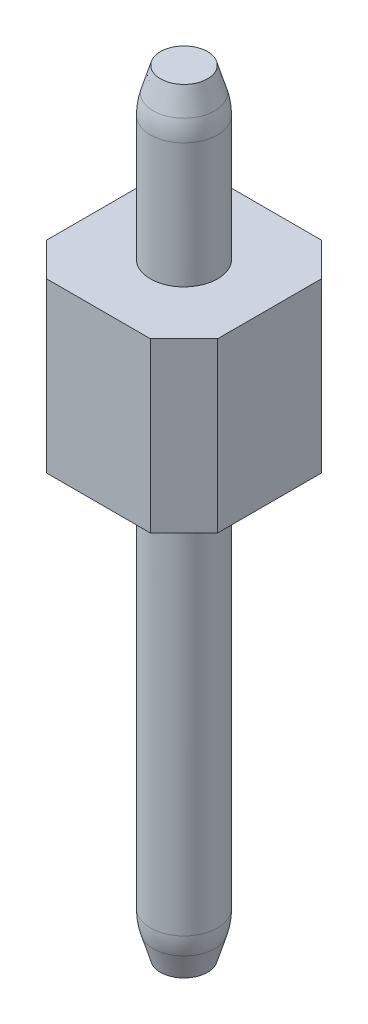
ISO-10303-21;
HEADER;
FILE_DESCRIPTION(('STEP AP214'),'2;1');
FILE_NAME('part.step','',(''),(''),'','','');
FILE_SCHEMA(('AUTOMOTIVE_DESIGN { 1 0 10303 214 1 1 1 1 }'));
ENDSEC;
DATA;
#1=APPLICATION_CONTEXT('core data for automotive mechanical design processes');
#2=APPLICATION_PROTOCOL_DEFINITION('international standard','automotive_design',2000,#1);
#3=PRODUCT_CONTEXT('',#1,'mechanical');
#4=PRODUCT('Part','Part','',(#3));
#5=PRODUCT_RELATED_PRODUCT_CATEGORY('part','',(#4));
#6=PRODUCT_DEFINITION_FORMATION('','',#4);
#7=PRODUCT_DEFINITION_CONTEXT('part definition',#1,'design');
#8=PRODUCT_DEFINITION('design','',#6,#7);
#9=PRODUCT_DEFINITION_SHAPE('','',#8);
#10=(LENGTH_UNIT() NAMED_UNIT(*) SI_UNIT(.MILLI.,.METRE.));
#11=(NAMED_UNIT(*) PLANE_ANGLE_UNIT() SI_UNIT($,.RADIAN.));
#12=(NAMED_UNIT(*) SI_UNIT($,.STERADIAN.) SOLID_ANGLE_UNIT());
#13=UNCERTAINTY_MEASURE_WITH_UNIT(LENGTH_MEASURE(1.E-05),#10,'distance_accuracy_value','');
#14=(GEOMETRIC_REPRESENTATION_CONTEXT(3) GLOBAL_UNCERTAINTY_ASSIGNED_CONTEXT((#13)) GLOBAL_UNIT_ASSIGNED_CONTEXT((#10,
#11,#12)) REPRESENTATION_CONTEXT('',''));
#15=CARTESIAN_POINT('',(0.,0.,0.));
#16=DIRECTION('',(0.,0.,1.));
#17=DIRECTION('',(1.,0.,0.));
#18=AXIS2_PLACEMENT_3D('',#15,#16,#17);
#19=CARTESIAN_POINT('',(0.,11.5,0.));
#20=DIRECTION('',(0.,-1.,0.));
#21=DIRECTION('',(0.,0.,-1.));
#22=AXIS2_PLACEMENT_3D('',#19,#20,#21);
#23=CYLINDRICAL_SURFACE('',#22,0.5);
#24=CARTESIAN_POINT('',(0.,10.8532311636965,0.));
#25=DIRECTION('',(0.,1.,0.));
#26=DIRECTION('',(0.,0.,1.));
#27=AXIS2_PLACEMENT_3D('',#24,#25,#26);
#28=CIRCLE('',#27,0.5);
#29=CARTESIAN_POINT('',(0.,10.8532311636965,0.5));
#30=VERTEX_POINT('',#29);
#31=EDGE_CURVE('E179',#30,#30,#28,.F.);
#32=ORIENTED_EDGE('',*,*,#31,.T.);
#33=EDGE_LOOP('',(#32));
#34=FACE_BOUND('',#33,.T.);
#35=CARTESIAN_POINT('',(0.,9.,0.));
#36=DIRECTION('',(0.,-1.,0.));
#37=DIRECTION('',(0.,0.,-1.));
#38=AXIS2_PLACEMENT_3D('',#35,#36,#37);
#39=CIRCLE('',#38,0.5);
#40=CARTESIAN_POINT('',(0.,9.,-0.5));
#41=VERTEX_POINT('',#40);
#42=EDGE_CURVE('E173',#41,#41,#39,.T.);
#43=ORIENTED_EDGE('',*,*,#42,.F.);
#44=EDGE_LOOP('',(#43));
#45=FACE_BOUND('',#44,.T.);
#46=ADVANCED_FACE('F48',(#34,#45),#23,.T.);
#47=CARTESIAN_POINT('',(0.,11.5,0.));
#48=DIRECTION('',(0.,1.,0.));
#49=DIRECTION('',(0.,0.,1.));
#50=AXIS2_PLACEMENT_3D('',#47,#48,#49);
#51=PLANE('',#50);
#52=CARTESIAN_POINT('',(0.,11.5,0.));
#53=DIRECTION('',(0.,1.,0.));
#54=DIRECTION('',(0.,0.,1.));
#55=AXIS2_PLACEMENT_3D('',#52,#53,#54);
#56=CIRCLE('',#55,0.350000000000005);
#57=CARTESIAN_POINT('',(0.,11.5,0.350000000000005));
#58=VERTEX_POINT('',#57);
#59=EDGE_CURVE('E176',#58,#58,#56,.T.);
#60=ORIENTED_EDGE('',*,*,#59,.T.);
#61=EDGE_LOOP('',(#60));
#62=FACE_BOUND('',#61,.T.);
#63=ADVANCED_FACE('F225',(#62),#51,.T.);
#64=CARTESIAN_POINT('',(-1.27,9.,0.77));
#65=DIRECTION('',(1.,0.,0.));
#66=DIRECTION('',(0.,0.,-1.));
#67=AXIS2_PLACEMENT_3D('',#64,#65,#66);
#68=PLANE('',#67);
#69=DIRECTION('',(0.,0.,1.));
#70=VECTOR('',#69,1.);
#71=CARTESIAN_POINT('',(-1.27,6.5,0.77));
#72=LINE('',#71,#70);
#73=CARTESIAN_POINT('',(-1.27,6.5,-0.77));
#74=VERTEX_POINT('',#73);
#75=CARTESIAN_POINT('',(-1.27,6.5,0.77));
#76=VERTEX_POINT('',#75);
#77=EDGE_CURVE('E143',#74,#76,#72,.T.);
#78=ORIENTED_EDGE('',*,*,#77,.T.);
#79=DIRECTION('',(0.,-1.,0.));
#80=VECTOR('',#79,1.);
#81=CARTESIAN_POINT('',(-1.27,9.,0.77));
#82=LINE('',#81,#80);
#83=CARTESIAN_POINT('',(-1.27,9.,0.77));
#84=VERTEX_POINT('',#83);
#85=EDGE_CURVE('E168',#84,#76,#82,.T.);
#86=ORIENTED_EDGE('',*,*,#85,.F.);
#87=DIRECTION('',(0.,0.,1.));
#88=VECTOR('',#87,1.);
#89=CARTESIAN_POINT('',(-1.27,9.,0.77));
#90=LINE('',#89,#88);
#91=CARTESIAN_POINT('',(-1.27,9.,-0.77));
#92=VERTEX_POINT('',#91);
#93=EDGE_CURVE('E156',#92,#84,#90,.T.);
#94=ORIENTED_EDGE('',*,*,#93,.F.);
#95=DIRECTION('',(0.,-1.,0.));
#96=VECTOR('',#95,1.);
#97=CARTESIAN_POINT('',(-1.27,9.,-0.77));
#98=LINE('',#97,#96);
#99=EDGE_CURVE('E139',#92,#74,#98,.T.);
#100=ORIENTED_EDGE('',*,*,#99,.T.);
#101=EDGE_LOOP('',(#78,#86,#94,#100));
#102=FACE_BOUND('',#101,.T.);
#103=ADVANCED_FACE('F230',(#102),#68,.F.);
#104=CARTESIAN_POINT('',(-1.27,9.,0.77));
#105=DIRECTION('',(0.707106781186548,0.,-0.707106781186548));
#106=DIRECTION('',(-0.707106781186548,0.,-0.707106781186548));
#107=AXIS2_PLACEMENT_3D('',#104,#105,#106);
#108=PLANE('',#107);
#109=DIRECTION('',(0.707106781186548,0.,0.707106781186548));
#110=VECTOR('',#109,1.);
#111=CARTESIAN_POINT('',(-1.27,6.5,0.77));
#112=LINE('',#111,#110);
#113=CARTESIAN_POINT('',(-0.77,6.5,1.27));
#114=VERTEX_POINT('',#113);
#115=EDGE_CURVE('E146',#76,#114,#112,.T.);
#116=ORIENTED_EDGE('',*,*,#115,.T.);
#117=DIRECTION('',(0.,-1.,0.));
#118=VECTOR('',#117,1.);
#119=CARTESIAN_POINT('',(-0.77,9.,1.27));
#120=LINE('',#119,#118);
#121=CARTESIAN_POINT('',(-0.77,9.,1.27));
#122=VERTEX_POINT('',#121);
#123=EDGE_CURVE('E165',#122,#114,#120,.T.);
#124=ORIENTED_EDGE('',*,*,#123,.F.);
#125=DIRECTION('',(0.707106781186548,0.,0.707106781186548));
#126=VECTOR('',#125,1.);
#127=CARTESIAN_POINT('',(-1.27,9.,0.77));
#128=LINE('',#127,#126);
#129=EDGE_CURVE('E107',#84,#122,#128,.T.);
#130=ORIENTED_EDGE('',*,*,#129,.F.);
#131=ORIENTED_EDGE('',*,*,#85,.T.);
#132=EDGE_LOOP('',(#116,#124,#130,#131));
#133=FACE_BOUND('',#132,.T.);
#134=ADVANCED_FACE('F303',(#133),#108,.F.);
#135=CARTESIAN_POINT('',(-0.77,9.,1.27));
#136=DIRECTION('',(0.,0.,-1.));
#137=DIRECTION('',(-1.,0.,0.));
#138=AXIS2_PLACEMENT_3D('',#135,#136,#137);
#139=PLANE('',#138);
#140=DIRECTION('',(1.,0.,0.));
#141=VECTOR('',#140,1.);
#142=CARTESIAN_POINT('',(-0.77,6.5,1.27));
#143=LINE('',#142,#141);
#144=CARTESIAN_POINT('',(0.77,6.5,1.27));
#145=VERTEX_POINT('',#144);
#146=EDGE_CURVE('E148',#114,#145,#143,.T.);
#147=ORIENTED_EDGE('',*,*,#146,.T.);
#148=DIRECTION('',(0.,-1.,0.));
#149=VECTOR('',#148,1.);
#150=CARTESIAN_POINT('',(0.77,9.,1.27));
#151=LINE('',#150,#149);
#152=CARTESIAN_POINT('',(0.77,9.,1.27));
#153=VERTEX_POINT('',#152);
#154=EDGE_CURVE('E162',#153,#145,#151,.T.);
#155=ORIENTED_EDGE('',*,*,#154,.F.);
#156=DIRECTION('',(1.,0.,0.));
#157=VECTOR('',#156,1.);
#158=CARTESIAN_POINT('',(-0.77,9.,1.27));
#159=LINE('',#158,#157);
#160=EDGE_CURVE('E377',#122,#153,#159,.T.);
#161=ORIENTED_EDGE('',*,*,#160,.F.);
#162=ORIENTED_EDGE('',*,*,#123,.T.);
#163=EDGE_LOOP('',(#147,#155,#161,#162));
#164=FACE_BOUND('',#163,.T.);
#165=ADVANCED_FACE('F292',(#164),#139,.F.);
#166=CARTESIAN_POINT('',(0.77,9.,1.27));
#167=DIRECTION('',(-0.707106781186548,0.,-0.707106781186548));
#168=DIRECTION('',(-0.707106781186548,0.,0.707106781186548));
#169=AXIS2_PLACEMENT_3D('',#166,#167,#168);
#170=PLANE('',#169);
#171=DIRECTION('',(0.707106781186548,0.,-0.707106781186548));
#172=VECTOR('',#171,1.);
#173=CARTESIAN_POINT('',(0.77,6.5,1.27));
#174=LINE('',#173,#172);
#175=CARTESIAN_POINT('',(1.27,6.5,0.77));
#176=VERTEX_POINT('',#175);
#177=EDGE_CURVE('E150',#145,#176,#174,.T.);
#178=ORIENTED_EDGE('',*,*,#177,.T.);
#179=DIRECTION('',(0.,-1.,0.));
#180=VECTOR('',#179,1.);
#181=CARTESIAN_POINT('',(1.27,9.,0.77));
#182=LINE('',#181,#180);
#183=CARTESIAN_POINT('',(1.27,9.,0.77));
#184=VERTEX_POINT('',#183);
#185=EDGE_CURVE('E160',#184,#176,#182,.T.);
#186=ORIENTED_EDGE('',*,*,#185,.F.);
#187=DIRECTION('',(0.707106781186548,0.,-0.707106781186548));
#188=VECTOR('',#187,1.);
#189=CARTESIAN_POINT('',(0.77,9.,1.27));
#190=LINE('',#189,#188);
#191=EDGE_CURVE('E128',#153,#184,#190,.T.);
#192=ORIENTED_EDGE('',*,*,#191,.F.);
#193=ORIENTED_EDGE('',*,*,#154,.T.);
#194=EDGE_LOOP('',(#178,#186,#192,#193));
#195=FACE_BOUND('',#194,.T.);
#196=ADVANCED_FACE('F282',(#195),#170,.F.);
#197=CARTESIAN_POINT('',(0.77,9.,-1.27));
#198=DIRECTION('',(-0.707106781186548,0.,0.707106781186548));
#199=DIRECTION('',(0.707106781186548,0.,0.707106781186548));
#200=AXIS2_PLACEMENT_3D('',#197,#198,#199);
#201=PLANE('',#200);
#202=DIRECTION('',(-0.707106781186548,0.,-0.707106781186548));
#203=VECTOR('',#202,1.);
#204=CARTESIAN_POINT('',(0.77,6.5,-1.27));
#205=LINE('',#204,#203);
#206=CARTESIAN_POINT('',(1.27,6.5,-0.77));
#207=VERTEX_POINT('',#206);
#208=CARTESIAN_POINT('',(0.77,6.5,-1.27));
#209=VERTEX_POINT('',#208);
#210=EDGE_CURVE('E133',#207,#209,#205,.T.);
#211=ORIENTED_EDGE('',*,*,#210,.T.);
#212=DIRECTION('',(0.,-1.,0.));
#213=VECTOR('',#212,1.);
#214=CARTESIAN_POINT('',(0.77,9.,-1.27));
#215=LINE('',#214,#213);
#216=CARTESIAN_POINT('',(0.77,9.,-1.27));
#217=VERTEX_POINT('',#216);
#218=EDGE_CURVE('E130',#217,#209,#215,.T.);
#219=ORIENTED_EDGE('',*,*,#218,.F.);
#220=DIRECTION('',(-0.707106781186548,0.,-0.707106781186548));
#221=VECTOR('',#220,1.);
#222=CARTESIAN_POINT('',(0.77,9.,-1.27));
#223=LINE('',#222,#221);
#224=CARTESIAN_POINT('',(1.27,9.,-0.77));
#225=VERTEX_POINT('',#224);
#226=EDGE_CURVE('E117',#225,#217,#223,.T.);
#227=ORIENTED_EDGE('',*,*,#226,.F.);
#228=DIRECTION('',(0.,-1.,0.));
#229=VECTOR('',#228,1.);
#230=CARTESIAN_POINT('',(1.27,9.,-0.77));
#231=LINE('',#230,#229);
#232=EDGE_CURVE('E134',#225,#207,#231,.T.);
#233=ORIENTED_EDGE('',*,*,#232,.T.);
#234=EDGE_LOOP('',(#211,#219,#227,#233));
#235=FACE_BOUND('',#234,.T.);
#236=ADVANCED_FACE('F131',(#235),#201,.F.);
#237=CARTESIAN_POINT('',(-0.77,9.,-1.27));
#238=DIRECTION('',(0.,0.,1.));
#239=DIRECTION('',(1.,0.,0.));
#240=AXIS2_PLACEMENT_3D('',#237,#238,#239);
#241=PLANE('',#240);
#242=DIRECTION('',(-1.,0.,0.));
#243=VECTOR('',#242,1.);
#244=CARTESIAN_POINT('',(-0.77,6.5,-1.27));
#245=LINE('',#244,#243);
#246=CARTESIAN_POINT('',(-0.77,6.5,-1.27));
#247=VERTEX_POINT('',#246);
#248=EDGE_CURVE('E92',#209,#247,#245,.T.);
#249=ORIENTED_EDGE('',*,*,#248,.T.);
#250=DIRECTION('',(0.,-1.,0.));
#251=VECTOR('',#250,1.);
#252=CARTESIAN_POINT('',(-0.77,9.,-1.27));
#253=LINE('',#252,#251);
#254=CARTESIAN_POINT('',(-0.77,9.,-1.27));
#255=VERTEX_POINT('',#254);
#256=EDGE_CURVE('E135',#255,#247,#253,.T.);
#257=ORIENTED_EDGE('',*,*,#256,.F.);
#258=DIRECTION('',(-1.,0.,0.));
#259=VECTOR('',#258,1.);
#260=CARTESIAN_POINT('',(-0.77,9.,-1.27));
#261=LINE('',#260,#259);
#262=EDGE_CURVE('E122',#217,#255,#261,.T.);
#263=ORIENTED_EDGE('',*,*,#262,.F.);
#264=ORIENTED_EDGE('',*,*,#218,.T.);
#265=EDGE_LOOP('',(#249,#257,#263,#264));
#266=FACE_BOUND('',#265,.T.);
#267=ADVANCED_FACE('F137',(#266),#241,.F.);
#268=CARTESIAN_POINT('',(-1.27,9.,-0.77));
#269=DIRECTION('',(0.707106781186548,0.,0.707106781186548));
#270=DIRECTION('',(0.707106781186548,0.,-0.707106781186548));
#271=AXIS2_PLACEMENT_3D('',#268,#269,#270);
#272=PLANE('',#271);
#273=DIRECTION('',(-0.707106781186548,0.,0.707106781186548));
#274=VECTOR('',#273,1.);
#275=CARTESIAN_POINT('',(-1.27,6.5,-0.77));
#276=LINE('',#275,#274);
#277=EDGE_CURVE('E98',#247,#74,#276,.T.);
#278=ORIENTED_EDGE('',*,*,#277,.T.);
#279=ORIENTED_EDGE('',*,*,#99,.F.);
#280=DIRECTION('',(-0.707106781186548,0.,0.707106781186548));
#281=VECTOR('',#280,1.);
#282=CARTESIAN_POINT('',(-1.27,9.,-0.77));
#283=LINE('',#282,#281);
#284=EDGE_CURVE('E65',#255,#92,#283,.T.);
#285=ORIENTED_EDGE('',*,*,#284,.F.);
#286=ORIENTED_EDGE('',*,*,#256,.T.);
#287=EDGE_LOOP('',(#278,#279,#285,#286));
#288=FACE_BOUND('',#287,.T.);
#289=ADVANCED_FACE('F219',(#288),#272,.F.);
#290=CARTESIAN_POINT('',(0.,9.,0.));
#291=DIRECTION('',(0.,-1.,0.));
#292=DIRECTION('',(0.,0.,-1.));
#293=AXIS2_PLACEMENT_3D('',#290,#291,#292);
#294=PLANE('',#293);
#295=ORIENTED_EDGE('',*,*,#42,.T.);
#296=EDGE_LOOP('',(#295));
#297=FACE_BOUND('',#296,.T.);
#298=ORIENTED_EDGE('',*,*,#191,.T.);
#299=DIRECTION('',(0.,0.,-1.));
#300=VECTOR('',#299,1.);
#301=CARTESIAN_POINT('',(1.27,9.,0.));
#302=LINE('',#301,#300);
#303=EDGE_CURVE('E125',#184,#225,#302,.T.);
#304=ORIENTED_EDGE('',*,*,#303,.T.);
#305=ORIENTED_EDGE('',*,*,#226,.T.);
#306=ORIENTED_EDGE('',*,*,#262,.T.);
#307=ORIENTED_EDGE('',*,*,#284,.T.);
#308=ORIENTED_EDGE('',*,*,#93,.T.);
#309=ORIENTED_EDGE('',*,*,#129,.T.);
#310=ORIENTED_EDGE('',*,*,#160,.T.);
#311=EDGE_LOOP('',(#298,#304,#305,#306,#307,#308,#309,#310));
#312=FACE_BOUND('',#311,.T.);
#313=ADVANCED_FACE('F120',(#297,#312),#294,.F.);
#314=CARTESIAN_POINT('',(0.,6.5,0.));
#315=DIRECTION('',(0.,-1.,0.));
#316=DIRECTION('',(0.,0.,-1.));
#317=AXIS2_PLACEMENT_3D('',#314,#315,#316);
#318=PLANE('',#317);
#319=DIRECTION('',(0.,0.,-1.));
#320=VECTOR('',#319,1.);
#321=CARTESIAN_POINT('',(1.27,6.5,0.));
#322=LINE('',#321,#320);
#323=EDGE_CURVE('E13',#176,#207,#322,.T.);
#324=ORIENTED_EDGE('',*,*,#323,.F.);
#325=ORIENTED_EDGE('',*,*,#177,.F.);
#326=ORIENTED_EDGE('',*,*,#146,.F.);
#327=ORIENTED_EDGE('',*,*,#115,.F.);
#328=ORIENTED_EDGE('',*,*,#77,.F.);
#329=ORIENTED_EDGE('',*,*,#277,.F.);
#330=ORIENTED_EDGE('',*,*,#248,.F.);
#331=ORIENTED_EDGE('',*,*,#210,.F.);
#332=EDGE_LOOP('',(#324,#325,#326,#327,#328,#329,#330,#331));
#333=FACE_BOUND('',#332,.T.);
#334=CARTESIAN_POINT('',(0.,6.5,0.));
#335=DIRECTION('',(0.,-1.,0.));
#336=DIRECTION('',(0.,0.,-1.));
#337=AXIS2_PLACEMENT_3D('',#334,#335,#336);
#338=CIRCLE('',#337,0.5);
#339=CARTESIAN_POINT('',(0.,6.5,-0.5));
#340=VERTEX_POINT('',#339);
#341=EDGE_CURVE('E170',#340,#340,#338,.T.);
#342=ORIENTED_EDGE('',*,*,#341,.F.);
#343=EDGE_LOOP('',(#342));
#344=FACE_BOUND('',#343,.T.);
#345=ADVANCED_FACE('F209',(#333,#344),#318,.T.);
#346=CARTESIAN_POINT('',(0.,0.,0.));
#347=DIRECTION('',(0.,1.,0.));
#348=DIRECTION('',(0.,0.,1.));
#349=AXIS2_PLACEMENT_3D('',#346,#347,#348);
#350=PLANE('',#349);
#351=CARTESIAN_POINT('',(0.,0.,0.));
#352=DIRECTION('',(0.,1.,0.));
#353=DIRECTION('',(0.,0.,1.));
#354=AXIS2_PLACEMENT_3D('',#351,#352,#353);
#355=CIRCLE('',#354,0.349999999999994);
#356=CARTESIAN_POINT('',(0.,0.,0.349999999999994));
#357=VERTEX_POINT('',#356);
#358=EDGE_CURVE('E185',#357,#357,#355,.F.);
#359=ORIENTED_EDGE('',*,*,#358,.T.);
#360=EDGE_LOOP('',(#359));
#361=FACE_BOUND('',#360,.T.);
#362=ADVANCED_FACE('F205',(#361),#350,.F.);
#363=CARTESIAN_POINT('',(0.,0.646768836303538,0.));
#364=DIRECTION('',(0.,-1.,0.));
#365=DIRECTION('',(0.,0.,-1.));
#366=AXIS2_PLACEMENT_3D('',#363,#364,#365);
#367=CIRCLE('',#366,0.5);
#368=CARTESIAN_POINT('',(0.,0.646768836303538,-0.5));
#369=VERTEX_POINT('',#368);
#370=EDGE_CURVE('E188',#369,#369,#367,.F.);
#371=ORIENTED_EDGE('',*,*,#370,.T.);
#372=EDGE_LOOP('',(#371));
#373=FACE_BOUND('',#372,.T.);
#374=ORIENTED_EDGE('',*,*,#341,.T.);
#375=EDGE_LOOP('',(#374));
#376=FACE_BOUND('',#375,.T.);
#377=ADVANCED_FACE('F201',(#373,#376),#23,.T.);
#378=CARTESIAN_POINT('',(0.,11.5,0.));
#379=DIRECTION('',(0.,-1.,0.));
#380=DIRECTION('',(0.,0.,-1.));
#381=AXIS2_PLACEMENT_3D('',#378,#379,#380);
#382=CONICAL_SURFACE('',#381,0.350000000000005,0.291456794477864);
#383=CARTESIAN_POINT('',(0.,11.1405790492628,0.));
#384=DIRECTION('',(0.,-1.,0.));
#385=DIRECTION('',(0.,0.,-1.));
#386=AXIS2_PLACEMENT_3D('',#383,#384,#385);
#387=CIRCLE('',#386,0.457826285221153);
#388=CARTESIAN_POINT('',(0.,11.1405790492628,-0.457826285221153));
#389=VERTEX_POINT('',#388);
#390=EDGE_CURVE('E182',#389,#389,#387,.F.);
#391=ORIENTED_EDGE('',*,*,#390,.T.);
#392=EDGE_LOOP('',(#391));
#393=FACE_BOUND('',#392,.T.);
#394=ORIENTED_EDGE('',*,*,#59,.F.);
#395=EDGE_LOOP('',(#394));
#396=FACE_BOUND('',#395,.T.);
#397=ADVANCED_FACE('F204',(#393,#396),#382,.T.);
#398=CARTESIAN_POINT('',(0.,10.8532311636965,0.));
#399=DIRECTION('',(0.,1.,0.));
#400=DIRECTION('',(0.,0.,1.));
#401=AXIS2_PLACEMENT_3D('',#398,#399,#400);
#402=DEGENERATE_TOROIDAL_SURFACE('',#401,0.5,1.,.F.);
#403=ORIENTED_EDGE('',*,*,#390,.F.);
#404=EDGE_LOOP('',(#403));
#405=FACE_BOUND('',#404,.T.);
#406=ORIENTED_EDGE('',*,*,#31,.F.);
#407=EDGE_LOOP('',(#406));
#408=FACE_BOUND('',#407,.T.);
#409=ADVANCED_FACE('F237',(#405,#408),#402,.F.);
#410=CARTESIAN_POINT('',(0.,0.500000000000021,0.));
#411=DIRECTION('',(0.,1.,0.));
#412=DIRECTION('',(0.,0.,1.));
#413=AXIS2_PLACEMENT_3D('',#410,#411,#412);
#414=CONICAL_SURFACE('',#413,0.5,0.291456794477866);
#415=CARTESIAN_POINT('',(0.,0.359420950737193,0.));
#416=DIRECTION('',(0.,1.,0.));
#417=DIRECTION('',(0.,0.,1.));
#418=AXIS2_PLACEMENT_3D('',#415,#416,#417);
#419=CIRCLE('',#418,0.457826285221152);
#420=CARTESIAN_POINT('',(0.,0.359420950737193,0.457826285221152));
#421=VERTEX_POINT('',#420);
#422=EDGE_CURVE('E57',#421,#421,#419,.F.);
#423=ORIENTED_EDGE('',*,*,#422,.T.);
#424=EDGE_LOOP('',(#423));
#425=FACE_BOUND('',#424,.T.);
#426=ORIENTED_EDGE('',*,*,#358,.F.);
#427=EDGE_LOOP('',(#426));
#428=FACE_BOUND('',#427,.T.);
#429=ADVANCED_FACE('F193',(#425,#428),#414,.T.);
#430=CARTESIAN_POINT('',(0.,0.646768836303538,0.));
#431=DIRECTION('',(0.,-1.,0.));
#432=DIRECTION('',(0.,0.,-1.));
#433=AXIS2_PLACEMENT_3D('',#430,#431,#432);
#434=DEGENERATE_TOROIDAL_SURFACE('',#433,0.5,1.,.F.);
#435=ORIENTED_EDGE('',*,*,#422,.F.);
#436=EDGE_LOOP('',(#435));
#437=FACE_BOUND('',#436,.T.);
#438=ORIENTED_EDGE('',*,*,#370,.F.);
#439=EDGE_LOOP('',(#438));
#440=FACE_BOUND('',#439,.T.);
#441=ADVANCED_FACE('F50',(#437,#440),#434,.F.);
#442=CARTESIAN_POINT('',(1.27,11.5,-1.27));
#443=DIRECTION('',(-1.,0.,0.));
#444=DIRECTION('',(0.,0.,1.));
#445=AXIS2_PLACEMENT_3D('',#442,#443,#444);
#446=PLANE('',#445);
#447=ORIENTED_EDGE('',*,*,#185,.T.);
#448=ORIENTED_EDGE('',*,*,#323,.T.);
#449=ORIENTED_EDGE('',*,*,#232,.F.);
#450=ORIENTED_EDGE('',*,*,#303,.F.);
#451=EDGE_LOOP('',(#447,#448,#449,#450));
#452=FACE_BOUND('',#451,.T.);
#453=ADVANCED_FACE('F198',(#452),#446,.F.);
#454=CLOSED_SHELL('',(#46,#63,#103,#134,#165,#196,#236,#267,#289,#313,#345,#362,#377,#397,#409,
#429,#441,#453));
#455=MANIFOLD_SOLID_BREP('B2',#454);
#456=ADVANCED_BREP_SHAPE_REPRESENTATION('',(#18,#455),#14);
#457=SHAPE_DEFINITION_REPRESENTATION(#9,#456);
ENDSEC;
END-ISO-10303-21;
